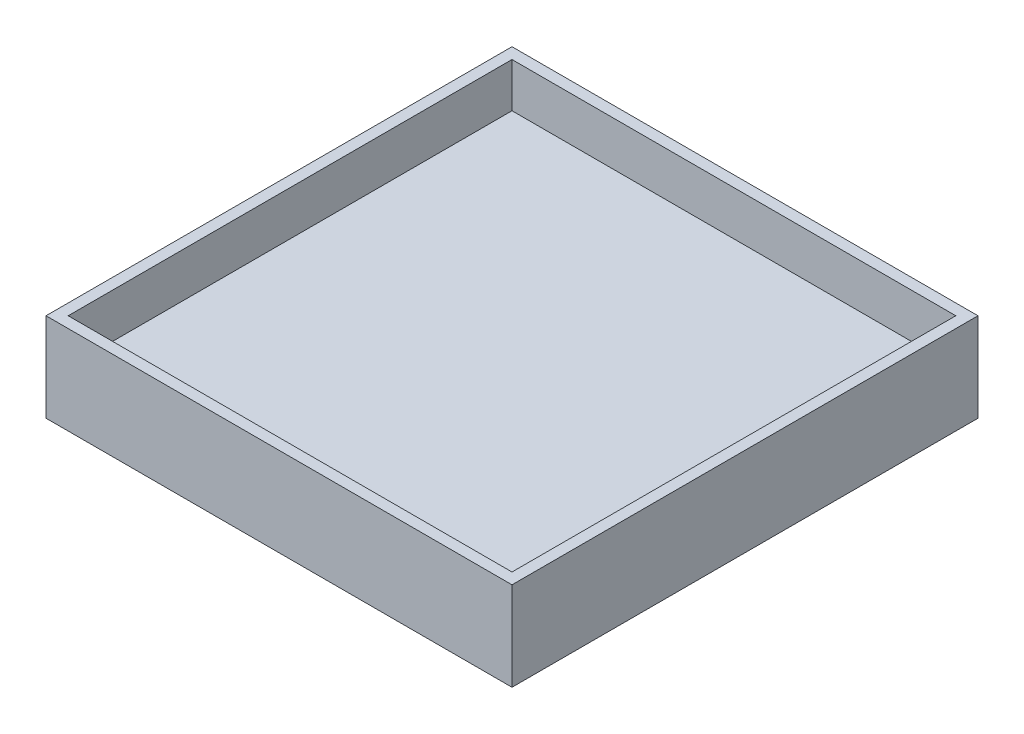
ISO-10303-21;
HEADER;
FILE_DESCRIPTION(('STEP AP214'),'2;1');
FILE_NAME('part.step','',(''),(''),'','','');
FILE_SCHEMA(('AUTOMOTIVE_DESIGN { 1 0 10303 214 1 1 1 1 }'));
ENDSEC;
DATA;
#1=APPLICATION_CONTEXT('core data for automotive mechanical design processes');
#2=APPLICATION_PROTOCOL_DEFINITION('international standard','automotive_design',2000,#1);
#3=PRODUCT_CONTEXT('',#1,'mechanical');
#4=PRODUCT('Part','Part','',(#3));
#5=PRODUCT_RELATED_PRODUCT_CATEGORY('part','',(#4));
#6=PRODUCT_DEFINITION_FORMATION('','',#4);
#7=PRODUCT_DEFINITION_CONTEXT('part definition',#1,'design');
#8=PRODUCT_DEFINITION('design','',#6,#7);
#9=PRODUCT_DEFINITION_SHAPE('','',#8);
#10=(LENGTH_UNIT() NAMED_UNIT(*) SI_UNIT(.MILLI.,.METRE.));
#11=(NAMED_UNIT(*) PLANE_ANGLE_UNIT() SI_UNIT($,.RADIAN.));
#12=(NAMED_UNIT(*) SI_UNIT($,.STERADIAN.) SOLID_ANGLE_UNIT());
#13=UNCERTAINTY_MEASURE_WITH_UNIT(LENGTH_MEASURE(1.E-05),#10,'distance_accuracy_value','');
#14=(GEOMETRIC_REPRESENTATION_CONTEXT(3) GLOBAL_UNCERTAINTY_ASSIGNED_CONTEXT((#13)) GLOBAL_UNIT_ASSIGNED_CONTEXT((#10,
#11,#12)) REPRESENTATION_CONTEXT('',''));
#15=CARTESIAN_POINT('',(0.,0.,0.));
#16=DIRECTION('',(0.,0.,1.));
#17=DIRECTION('',(1.,0.,0.));
#18=AXIS2_PLACEMENT_3D('',#15,#16,#17);
#19=CARTESIAN_POINT('',(0.,0.,0.));
#20=DIRECTION('',(0.,-1.,0.));
#21=DIRECTION('',(0.,0.,-1.));
#22=AXIS2_PLACEMENT_3D('',#19,#20,#21);
#23=PLANE('',#22);
#24=DIRECTION('',(0.,0.,1.));
#25=VECTOR('',#24,1.);
#26=CARTESIAN_POINT('',(15.,0.,0.));
#27=LINE('',#26,#25);
#28=CARTESIAN_POINT('',(15.,0.,17.5));
#29=VERTEX_POINT('',#28);
#30=CARTESIAN_POINT('',(15.,0.,-17.5));
#31=VERTEX_POINT('',#30);
#32=EDGE_CURVE('E256',#29,#31,#27,.F.);
#33=ORIENTED_EDGE('',*,*,#32,.T.);
#34=DIRECTION('',(1.,0.,0.));
#35=VECTOR('',#34,1.);
#36=CARTESIAN_POINT('',(0.,0.,-17.5));
#37=LINE('',#36,#35);
#38=CARTESIAN_POINT('',(-15.,0.,-17.5));
#39=VERTEX_POINT('',#38);
#40=EDGE_CURVE('E258',#31,#39,#37,.F.);
#41=ORIENTED_EDGE('',*,*,#40,.T.);
#42=DIRECTION('',(0.,0.,-1.));
#43=VECTOR('',#42,1.);
#44=CARTESIAN_POINT('',(-15.,0.,0.));
#45=LINE('',#44,#43);
#46=CARTESIAN_POINT('',(-15.,0.,17.5));
#47=VERTEX_POINT('',#46);
#48=EDGE_CURVE('E252',#39,#47,#45,.F.);
#49=ORIENTED_EDGE('',*,*,#48,.T.);
#50=DIRECTION('',(-1.,0.,0.));
#51=VECTOR('',#50,1.);
#52=CARTESIAN_POINT('',(0.,0.,17.5));
#53=LINE('',#52,#51);
#54=EDGE_CURVE('E254',#47,#29,#53,.F.);
#55=ORIENTED_EDGE('',*,*,#54,.T.);
#56=EDGE_LOOP('',(#33,#41,#49,#55));
#57=FACE_BOUND('',#56,.T.);
#58=DIRECTION('',(0.,0.,-1.));
#59=VECTOR('',#58,1.);
#60=CARTESIAN_POINT('',(-525.,0.,525.));
#61=LINE('',#60,#59);
#62=CARTESIAN_POINT('',(-525.,0.,525.));
#63=VERTEX_POINT('',#62);
#64=CARTESIAN_POINT('',(-525.,0.,-525.));
#65=VERTEX_POINT('',#64);
#66=EDGE_CURVE('E206',#63,#65,#61,.T.);
#67=ORIENTED_EDGE('',*,*,#66,.T.);
#68=DIRECTION('',(1.,0.,0.));
#69=VECTOR('',#68,1.);
#70=CARTESIAN_POINT('',(-525.,0.,-525.));
#71=LINE('',#70,#69);
#72=CARTESIAN_POINT('',(525.,0.,-525.));
#73=VERTEX_POINT('',#72);
#74=EDGE_CURVE('E225',#65,#73,#71,.T.);
#75=ORIENTED_EDGE('',*,*,#74,.T.);
#76=DIRECTION('',(0.,0.,-1.));
#77=VECTOR('',#76,1.);
#78=CARTESIAN_POINT('',(525.,0.,525.));
#79=LINE('',#78,#77);
#80=CARTESIAN_POINT('',(525.,0.,525.));
#81=VERTEX_POINT('',#80);
#82=EDGE_CURVE('E228',#81,#73,#79,.T.);
#83=ORIENTED_EDGE('',*,*,#82,.F.);
#84=DIRECTION('',(1.,0.,0.));
#85=VECTOR('',#84,1.);
#86=CARTESIAN_POINT('',(-525.,0.,525.));
#87=LINE('',#86,#85);
#88=EDGE_CURVE('E215',#63,#81,#87,.T.);
#89=ORIENTED_EDGE('',*,*,#88,.F.);
#90=EDGE_LOOP('',(#67,#75,#83,#89));
#91=FACE_BOUND('',#90,.T.);
#92=ADVANCED_FACE('F57',(#57,#91),#23,.T.);
#93=CARTESIAN_POINT('',(0.,100.,0.));
#94=DIRECTION('',(0.,-1.,0.));
#95=DIRECTION('',(0.,0.,-1.));
#96=AXIS2_PLACEMENT_3D('',#93,#94,#95);
#97=PLANE('',#96);
#98=DIRECTION('',(0.,0.,-1.));
#99=VECTOR('',#98,1.);
#100=CARTESIAN_POINT('',(500.,100.,500.));
#101=LINE('',#100,#99);
#102=CARTESIAN_POINT('',(500.,100.,500.));
#103=VERTEX_POINT('',#102);
#104=CARTESIAN_POINT('',(500.,100.,-500.));
#105=VERTEX_POINT('',#104);
#106=EDGE_CURVE('E234',#103,#105,#101,.T.);
#107=ORIENTED_EDGE('',*,*,#106,.T.);
#108=DIRECTION('',(-1.,0.,0.));
#109=VECTOR('',#108,1.);
#110=CARTESIAN_POINT('',(-500.,100.,-500.));
#111=LINE('',#110,#109);
#112=CARTESIAN_POINT('',(-500.,100.,-500.));
#113=VERTEX_POINT('',#112);
#114=EDGE_CURVE('E243',#105,#113,#111,.T.);
#115=ORIENTED_EDGE('',*,*,#114,.T.);
#116=DIRECTION('',(0.,0.,1.));
#117=VECTOR('',#116,1.);
#118=CARTESIAN_POINT('',(-500.,100.,500.));
#119=LINE('',#118,#117);
#120=CARTESIAN_POINT('',(-500.,100.,500.));
#121=VERTEX_POINT('',#120);
#122=EDGE_CURVE('E179',#113,#121,#119,.T.);
#123=ORIENTED_EDGE('',*,*,#122,.T.);
#124=DIRECTION('',(1.,0.,0.));
#125=VECTOR('',#124,1.);
#126=CARTESIAN_POINT('',(-500.,100.,500.));
#127=LINE('',#126,#125);
#128=EDGE_CURVE('E246',#121,#103,#127,.T.);
#129=ORIENTED_EDGE('',*,*,#128,.T.);
#130=EDGE_LOOP('',(#107,#115,#123,#129));
#131=FACE_BOUND('',#130,.T.);
#132=ADVANCED_FACE('F371',(#131),#97,.F.);
#133=CARTESIAN_POINT('',(-500.,200.,500.));
#134=DIRECTION('',(-1.,0.,0.));
#135=DIRECTION('',(0.,0.,1.));
#136=AXIS2_PLACEMENT_3D('',#133,#134,#135);
#137=PLANE('',#136);
#138=DIRECTION('',(0.,-1.,0.));
#139=VECTOR('',#138,1.);
#140=CARTESIAN_POINT('',(-500.,200.,500.));
#141=LINE('',#140,#139);
#142=CARTESIAN_POINT('',(-500.,200.,500.));
#143=VERTEX_POINT('',#142);
#144=EDGE_CURVE('E204',#143,#121,#141,.T.);
#145=ORIENTED_EDGE('',*,*,#144,.T.);
#146=ORIENTED_EDGE('',*,*,#122,.F.);
#147=DIRECTION('',(0.,-1.,0.));
#148=VECTOR('',#147,1.);
#149=CARTESIAN_POINT('',(-500.,200.,-500.));
#150=LINE('',#149,#148);
#151=CARTESIAN_POINT('',(-500.,200.,-500.));
#152=VERTEX_POINT('',#151);
#153=EDGE_CURVE('E171',#152,#113,#150,.T.);
#154=ORIENTED_EDGE('',*,*,#153,.F.);
#155=DIRECTION('',(0.,0.,-1.));
#156=VECTOR('',#155,1.);
#157=CARTESIAN_POINT('',(-500.,200.,500.));
#158=LINE('',#157,#156);
#159=EDGE_CURVE('E176',#143,#152,#158,.T.);
#160=ORIENTED_EDGE('',*,*,#159,.F.);
#161=EDGE_LOOP('',(#145,#146,#154,#160));
#162=FACE_BOUND('',#161,.T.);
#163=ADVANCED_FACE('F174',(#162),#137,.F.);
#164=CARTESIAN_POINT('',(-500.,200.,500.));
#165=DIRECTION('',(0.,0.,-1.));
#166=DIRECTION('',(-1.,0.,0.));
#167=AXIS2_PLACEMENT_3D('',#164,#165,#166);
#168=PLANE('',#167);
#169=ORIENTED_EDGE('',*,*,#128,.F.);
#170=ORIENTED_EDGE('',*,*,#144,.F.);
#171=DIRECTION('',(1.,0.,0.));
#172=VECTOR('',#171,1.);
#173=CARTESIAN_POINT('',(-500.,200.,500.));
#174=LINE('',#173,#172);
#175=CARTESIAN_POINT('',(500.,200.,500.));
#176=VERTEX_POINT('',#175);
#177=EDGE_CURVE('E183',#143,#176,#174,.T.);
#178=ORIENTED_EDGE('',*,*,#177,.T.);
#179=DIRECTION('',(0.,-1.,0.));
#180=VECTOR('',#179,1.);
#181=CARTESIAN_POINT('',(500.,200.,500.));
#182=LINE('',#181,#180);
#183=EDGE_CURVE('E207',#176,#103,#182,.T.);
#184=ORIENTED_EDGE('',*,*,#183,.T.);
#185=EDGE_LOOP('',(#169,#170,#178,#184));
#186=FACE_BOUND('',#185,.T.);
#187=ADVANCED_FACE('F544',(#186),#168,.T.);
#188=CARTESIAN_POINT('',(500.,200.,500.));
#189=DIRECTION('',(-1.,0.,0.));
#190=DIRECTION('',(0.,0.,1.));
#191=AXIS2_PLACEMENT_3D('',#188,#189,#190);
#192=PLANE('',#191);
#193=ORIENTED_EDGE('',*,*,#106,.F.);
#194=ORIENTED_EDGE('',*,*,#183,.F.);
#195=DIRECTION('',(0.,0.,-1.));
#196=VECTOR('',#195,1.);
#197=CARTESIAN_POINT('',(500.,200.,500.));
#198=LINE('',#197,#196);
#199=CARTESIAN_POINT('',(500.,200.,-500.));
#200=VERTEX_POINT('',#199);
#201=EDGE_CURVE('E192',#176,#200,#198,.T.);
#202=ORIENTED_EDGE('',*,*,#201,.T.);
#203=DIRECTION('',(0.,-1.,0.));
#204=VECTOR('',#203,1.);
#205=CARTESIAN_POINT('',(500.,200.,-500.));
#206=LINE('',#205,#204);
#207=EDGE_CURVE('E182',#200,#105,#206,.T.);
#208=ORIENTED_EDGE('',*,*,#207,.T.);
#209=EDGE_LOOP('',(#193,#194,#202,#208));
#210=FACE_BOUND('',#209,.T.);
#211=ADVANCED_FACE('F537',(#210),#192,.T.);
#212=CARTESIAN_POINT('',(-500.,200.,-500.));
#213=DIRECTION('',(0.,0.,-1.));
#214=DIRECTION('',(-1.,0.,0.));
#215=AXIS2_PLACEMENT_3D('',#212,#213,#214);
#216=PLANE('',#215);
#217=ORIENTED_EDGE('',*,*,#153,.T.);
#218=ORIENTED_EDGE('',*,*,#114,.F.);
#219=ORIENTED_EDGE('',*,*,#207,.F.);
#220=DIRECTION('',(1.,0.,0.));
#221=VECTOR('',#220,1.);
#222=CARTESIAN_POINT('',(-500.,200.,-500.));
#223=LINE('',#222,#221);
#224=EDGE_CURVE('E186',#152,#200,#223,.T.);
#225=ORIENTED_EDGE('',*,*,#224,.F.);
#226=EDGE_LOOP('',(#217,#218,#219,#225));
#227=FACE_BOUND('',#226,.T.);
#228=ADVANCED_FACE('F187',(#227),#216,.F.);
#229=CARTESIAN_POINT('',(-525.,200.,525.));
#230=DIRECTION('',(-1.,0.,0.));
#231=DIRECTION('',(0.,0.,1.));
#232=AXIS2_PLACEMENT_3D('',#229,#230,#231);
#233=PLANE('',#232);
#234=ORIENTED_EDGE('',*,*,#66,.F.);
#235=DIRECTION('',(0.,-1.,0.));
#236=VECTOR('',#235,1.);
#237=CARTESIAN_POINT('',(-525.,200.,525.));
#238=LINE('',#237,#236);
#239=CARTESIAN_POINT('',(-525.,200.,525.));
#240=VERTEX_POINT('',#239);
#241=EDGE_CURVE('E232',#240,#63,#238,.T.);
#242=ORIENTED_EDGE('',*,*,#241,.F.);
#243=DIRECTION('',(0.,0.,-1.));
#244=VECTOR('',#243,1.);
#245=CARTESIAN_POINT('',(-525.,200.,525.));
#246=LINE('',#245,#244);
#247=CARTESIAN_POINT('',(-525.,200.,-525.));
#248=VERTEX_POINT('',#247);
#249=EDGE_CURVE('E211',#240,#248,#246,.T.);
#250=ORIENTED_EDGE('',*,*,#249,.T.);
#251=DIRECTION('',(0.,-1.,0.));
#252=VECTOR('',#251,1.);
#253=CARTESIAN_POINT('',(-525.,200.,-525.));
#254=LINE('',#253,#252);
#255=EDGE_CURVE('E222',#248,#65,#254,.T.);
#256=ORIENTED_EDGE('',*,*,#255,.T.);
#257=EDGE_LOOP('',(#234,#242,#250,#256));
#258=FACE_BOUND('',#257,.T.);
#259=ADVANCED_FACE('F523',(#258),#233,.T.);
#260=CARTESIAN_POINT('',(-525.,200.,525.));
#261=DIRECTION('',(0.,0.,-1.));
#262=DIRECTION('',(-1.,0.,0.));
#263=AXIS2_PLACEMENT_3D('',#260,#261,#262);
#264=PLANE('',#263);
#265=ORIENTED_EDGE('',*,*,#88,.T.);
#266=DIRECTION('',(0.,-1.,0.));
#267=VECTOR('',#266,1.);
#268=CARTESIAN_POINT('',(525.,200.,525.));
#269=LINE('',#268,#267);
#270=CARTESIAN_POINT('',(525.,200.,525.));
#271=VERTEX_POINT('',#270);
#272=EDGE_CURVE('E235',#271,#81,#269,.T.);
#273=ORIENTED_EDGE('',*,*,#272,.F.);
#274=DIRECTION('',(1.,0.,0.));
#275=VECTOR('',#274,1.);
#276=CARTESIAN_POINT('',(-525.,200.,525.));
#277=LINE('',#276,#275);
#278=EDGE_CURVE('E220',#240,#271,#277,.T.);
#279=ORIENTED_EDGE('',*,*,#278,.F.);
#280=ORIENTED_EDGE('',*,*,#241,.T.);
#281=EDGE_LOOP('',(#265,#273,#279,#280));
#282=FACE_BOUND('',#281,.T.);
#283=ADVANCED_FACE('F515',(#282),#264,.F.);
#284=CARTESIAN_POINT('',(525.,200.,525.));
#285=DIRECTION('',(-1.,0.,0.));
#286=DIRECTION('',(0.,0.,1.));
#287=AXIS2_PLACEMENT_3D('',#284,#285,#286);
#288=PLANE('',#287);
#289=ORIENTED_EDGE('',*,*,#82,.T.);
#290=DIRECTION('',(0.,-1.,0.));
#291=VECTOR('',#290,1.);
#292=CARTESIAN_POINT('',(525.,200.,-525.));
#293=LINE('',#292,#291);
#294=CARTESIAN_POINT('',(525.,200.,-525.));
#295=VERTEX_POINT('',#294);
#296=EDGE_CURVE('E238',#295,#73,#293,.T.);
#297=ORIENTED_EDGE('',*,*,#296,.F.);
#298=DIRECTION('',(0.,0.,-1.));
#299=VECTOR('',#298,1.);
#300=CARTESIAN_POINT('',(525.,200.,525.));
#301=LINE('',#300,#299);
#302=EDGE_CURVE('E218',#271,#295,#301,.T.);
#303=ORIENTED_EDGE('',*,*,#302,.F.);
#304=ORIENTED_EDGE('',*,*,#272,.T.);
#305=EDGE_LOOP('',(#289,#297,#303,#304));
#306=FACE_BOUND('',#305,.T.);
#307=ADVANCED_FACE('F507',(#306),#288,.F.);
#308=CARTESIAN_POINT('',(-525.,200.,-525.));
#309=DIRECTION('',(0.,0.,-1.));
#310=DIRECTION('',(-1.,0.,0.));
#311=AXIS2_PLACEMENT_3D('',#308,#309,#310);
#312=PLANE('',#311);
#313=ORIENTED_EDGE('',*,*,#74,.F.);
#314=ORIENTED_EDGE('',*,*,#255,.F.);
#315=DIRECTION('',(1.,0.,0.));
#316=VECTOR('',#315,1.);
#317=CARTESIAN_POINT('',(-525.,200.,-525.));
#318=LINE('',#317,#316);
#319=EDGE_CURVE('E214',#248,#295,#318,.T.);
#320=ORIENTED_EDGE('',*,*,#319,.T.);
#321=ORIENTED_EDGE('',*,*,#296,.T.);
#322=EDGE_LOOP('',(#313,#314,#320,#321));
#323=FACE_BOUND('',#322,.T.);
#324=ADVANCED_FACE('F500',(#323),#312,.T.);
#325=CARTESIAN_POINT('',(0.,200.,0.));
#326=DIRECTION('',(0.,-1.,0.));
#327=DIRECTION('',(0.,0.,-1.));
#328=AXIS2_PLACEMENT_3D('',#325,#326,#327);
#329=PLANE('',#328);
#330=ORIENTED_EDGE('',*,*,#177,.F.);
#331=ORIENTED_EDGE('',*,*,#159,.T.);
#332=ORIENTED_EDGE('',*,*,#224,.T.);
#333=ORIENTED_EDGE('',*,*,#201,.F.);
#334=EDGE_LOOP('',(#330,#331,#332,#333));
#335=FACE_BOUND('',#334,.T.);
#336=ORIENTED_EDGE('',*,*,#249,.F.);
#337=ORIENTED_EDGE('',*,*,#278,.T.);
#338=ORIENTED_EDGE('',*,*,#302,.T.);
#339=ORIENTED_EDGE('',*,*,#319,.F.);
#340=EDGE_LOOP('',(#336,#337,#338,#339));
#341=FACE_BOUND('',#340,.T.);
#342=ADVANCED_FACE('F194',(#335,#341),#329,.F.);
#343=CARTESIAN_POINT('',(12.5,-25.,15.));
#344=DIRECTION('',(-1.,0.,0.));
#345=DIRECTION('',(0.,0.,1.));
#346=AXIS2_PLACEMENT_3D('',#343,#344,#345);
#347=PLANE('',#346);
#348=DIRECTION('',(0.,1.,0.));
#349=VECTOR('',#348,1.);
#350=CARTESIAN_POINT('',(12.5,-25.,15.));
#351=LINE('',#350,#349);
#352=CARTESIAN_POINT('',(12.5,-15.,15.));
#353=VERTEX_POINT('',#352);
#354=CARTESIAN_POINT('',(12.5,-2.5,15.));
#355=VERTEX_POINT('',#354);
#356=EDGE_CURVE('E196',#353,#355,#351,.T.);
#357=ORIENTED_EDGE('',*,*,#356,.F.);
#358=DIRECTION('',(0.,0.,1.));
#359=VECTOR('',#358,1.);
#360=CARTESIAN_POINT('',(12.5,-15.,-15.));
#361=LINE('',#360,#359);
#362=CARTESIAN_POINT('',(12.5,-15.,-15.));
#363=VERTEX_POINT('',#362);
#364=EDGE_CURVE('E81',#353,#363,#361,.F.);
#365=ORIENTED_EDGE('',*,*,#364,.T.);
#366=DIRECTION('',(0.,1.,0.));
#367=VECTOR('',#366,1.);
#368=CARTESIAN_POINT('',(12.5,-25.,-15.));
#369=LINE('',#368,#367);
#370=CARTESIAN_POINT('',(12.5,-2.5,-15.));
#371=VERTEX_POINT('',#370);
#372=EDGE_CURVE('E299',#363,#371,#369,.T.);
#373=ORIENTED_EDGE('',*,*,#372,.T.);
#374=DIRECTION('',(0.,0.,1.));
#375=VECTOR('',#374,1.);
#376=CARTESIAN_POINT('',(12.5,-2.5,15.));
#377=LINE('',#376,#375);
#378=EDGE_CURVE('E261',#371,#355,#377,.T.);
#379=ORIENTED_EDGE('',*,*,#378,.T.);
#380=EDGE_LOOP('',(#357,#365,#373,#379));
#381=FACE_BOUND('',#380,.T.);
#382=ADVANCED_FACE('F311',(#381),#347,.F.);
#383=CARTESIAN_POINT('',(-12.5,-25.,15.));
#384=DIRECTION('',(0.,0.,-1.));
#385=DIRECTION('',(-1.,0.,0.));
#386=AXIS2_PLACEMENT_3D('',#383,#384,#385);
#387=PLANE('',#386);
#388=CARTESIAN_POINT('',(0.,-17.5,15.));
#389=DIRECTION('',(0.,0.,-1.));
#390=DIRECTION('',(-1.,0.,0.));
#391=AXIS2_PLACEMENT_3D('',#388,#389,#390);
#392=CIRCLE('',#391,5.);
#393=CARTESIAN_POINT('',(-5.00000000000001,-17.5,15.));
#394=VERTEX_POINT('',#393);
#395=EDGE_CURVE('E275',#394,#394,#392,.T.);
#396=ORIENTED_EDGE('',*,*,#395,.T.);
#397=EDGE_LOOP('',(#396));
#398=FACE_BOUND('',#397,.T.);
#399=DIRECTION('',(-1.,0.,0.));
#400=VECTOR('',#399,1.);
#401=CARTESIAN_POINT('',(-12.5,-25.,15.));
#402=LINE('',#401,#400);
#403=CARTESIAN_POINT('',(2.5,-25.,15.));
#404=VERTEX_POINT('',#403);
#405=CARTESIAN_POINT('',(-2.50000000000001,-25.,15.));
#406=VERTEX_POINT('',#405);
#407=EDGE_CURVE('E283',#404,#406,#402,.T.);
#408=ORIENTED_EDGE('',*,*,#407,.F.);
#409=CARTESIAN_POINT('',(2.5,-15.,15.));
#410=DIRECTION('',(0.,0.,-1.));
#411=DIRECTION('',(-1.,0.,0.));
#412=AXIS2_PLACEMENT_3D('',#409,#410,#411);
#413=CIRCLE('',#412,10.);
#414=EDGE_CURVE('E291',#404,#353,#413,.F.);
#415=ORIENTED_EDGE('',*,*,#414,.T.);
#416=ORIENTED_EDGE('',*,*,#356,.T.);
#417=DIRECTION('',(-1.,0.,0.));
#418=VECTOR('',#417,1.);
#419=CARTESIAN_POINT('',(-12.5,-2.5,15.));
#420=LINE('',#419,#418);
#421=CARTESIAN_POINT('',(-12.5,-2.5,15.));
#422=VERTEX_POINT('',#421);
#423=EDGE_CURVE('E264',#355,#422,#420,.T.);
#424=ORIENTED_EDGE('',*,*,#423,.T.);
#425=DIRECTION('',(0.,1.,0.));
#426=VECTOR('',#425,1.);
#427=CARTESIAN_POINT('',(-12.5,-25.,15.));
#428=LINE('',#427,#426);
#429=CARTESIAN_POINT('',(-12.5,-15.,15.));
#430=VERTEX_POINT('',#429);
#431=EDGE_CURVE('E198',#430,#422,#428,.T.);
#432=ORIENTED_EDGE('',*,*,#431,.F.);
#433=CARTESIAN_POINT('',(-2.50000000000001,-15.,15.));
#434=DIRECTION('',(0.,0.,-1.));
#435=DIRECTION('',(-1.,0.,0.));
#436=AXIS2_PLACEMENT_3D('',#433,#434,#435);
#437=CIRCLE('',#436,10.);
#438=EDGE_CURVE('E289',#430,#406,#437,.F.);
#439=ORIENTED_EDGE('',*,*,#438,.T.);
#440=EDGE_LOOP('',(#408,#415,#416,#424,#432,#439));
#441=FACE_BOUND('',#440,.T.);
#442=ADVANCED_FACE('F310',(#398,#441),#387,.F.);
#443=CARTESIAN_POINT('',(-12.5,-25.,15.));
#444=DIRECTION('',(1.,0.,0.));
#445=DIRECTION('',(0.,0.,-1.));
#446=AXIS2_PLACEMENT_3D('',#443,#444,#445);
#447=PLANE('',#446);
#448=DIRECTION('',(0.,1.,0.));
#449=VECTOR('',#448,1.);
#450=CARTESIAN_POINT('',(-12.5,-25.,-15.));
#451=LINE('',#450,#449);
#452=CARTESIAN_POINT('',(-12.5,-15.,-15.));
#453=VERTEX_POINT('',#452);
#454=CARTESIAN_POINT('',(-12.5,-2.5,-15.));
#455=VERTEX_POINT('',#454);
#456=EDGE_CURVE('E337',#453,#455,#451,.T.);
#457=ORIENTED_EDGE('',*,*,#456,.F.);
#458=DIRECTION('',(0.,0.,-1.));
#459=VECTOR('',#458,1.);
#460=CARTESIAN_POINT('',(-12.5,-15.,15.));
#461=LINE('',#460,#459);
#462=EDGE_CURVE('E12',#453,#430,#461,.F.);
#463=ORIENTED_EDGE('',*,*,#462,.T.);
#464=ORIENTED_EDGE('',*,*,#431,.T.);
#465=DIRECTION('',(0.,0.,-1.));
#466=VECTOR('',#465,1.);
#467=CARTESIAN_POINT('',(-12.5,-2.5,15.));
#468=LINE('',#467,#466);
#469=EDGE_CURVE('E267',#422,#455,#468,.T.);
#470=ORIENTED_EDGE('',*,*,#469,.T.);
#471=EDGE_LOOP('',(#457,#463,#464,#470));
#472=FACE_BOUND('',#471,.T.);
#473=ADVANCED_FACE('F336',(#472),#447,.F.);
#474=CARTESIAN_POINT('',(-12.5,-25.,-15.));
#475=DIRECTION('',(0.,0.,1.));
#476=DIRECTION('',(1.,0.,0.));
#477=AXIS2_PLACEMENT_3D('',#474,#475,#476);
#478=PLANE('',#477);
#479=CARTESIAN_POINT('',(0.,-17.5,-15.));
#480=DIRECTION('',(0.,0.,1.));
#481=DIRECTION('',(1.,0.,0.));
#482=AXIS2_PLACEMENT_3D('',#479,#480,#481);
#483=CIRCLE('',#482,5.);
#484=CARTESIAN_POINT('',(5.,-17.5,-15.));
#485=VERTEX_POINT('',#484);
#486=EDGE_CURVE('E61',#485,#485,#483,.T.);
#487=ORIENTED_EDGE('',*,*,#486,.T.);
#488=EDGE_LOOP('',(#487));
#489=FACE_BOUND('',#488,.T.);
#490=ORIENTED_EDGE('',*,*,#372,.F.);
#491=CARTESIAN_POINT('',(2.5,-15.,-15.));
#492=DIRECTION('',(0.,0.,1.));
#493=DIRECTION('',(1.,0.,0.));
#494=AXIS2_PLACEMENT_3D('',#491,#492,#493);
#495=CIRCLE('',#494,10.);
#496=CARTESIAN_POINT('',(2.5,-25.,-15.));
#497=VERTEX_POINT('',#496);
#498=EDGE_CURVE('E66',#363,#497,#495,.F.);
#499=ORIENTED_EDGE('',*,*,#498,.T.);
#500=DIRECTION('',(1.,0.,0.));
#501=VECTOR('',#500,1.);
#502=CARTESIAN_POINT('',(-12.5,-25.,-15.));
#503=LINE('',#502,#501);
#504=CARTESIAN_POINT('',(-2.5,-25.,-15.));
#505=VERTEX_POINT('',#504);
#506=EDGE_CURVE('E298',#505,#497,#503,.T.);
#507=ORIENTED_EDGE('',*,*,#506,.F.);
#508=CARTESIAN_POINT('',(-2.5,-15.,-15.));
#509=DIRECTION('',(0.,0.,1.));
#510=DIRECTION('',(1.,0.,0.));
#511=AXIS2_PLACEMENT_3D('',#508,#509,#510);
#512=CIRCLE('',#511,10.);
#513=EDGE_CURVE('E73',#505,#453,#512,.F.);
#514=ORIENTED_EDGE('',*,*,#513,.T.);
#515=ORIENTED_EDGE('',*,*,#456,.T.);
#516=DIRECTION('',(1.,0.,0.));
#517=VECTOR('',#516,1.);
#518=CARTESIAN_POINT('',(-12.5,-2.5,-15.));
#519=LINE('',#518,#517);
#520=EDGE_CURVE('E249',#455,#371,#519,.T.);
#521=ORIENTED_EDGE('',*,*,#520,.T.);
#522=EDGE_LOOP('',(#490,#499,#507,#514,#515,#521));
#523=FACE_BOUND('',#522,.T.);
#524=ADVANCED_FACE('F297',(#489,#523),#478,.F.);
#525=CARTESIAN_POINT('',(0.,-25.,0.));
#526=DIRECTION('',(0.,-1.,0.));
#527=DIRECTION('',(0.,0.,-1.));
#528=AXIS2_PLACEMENT_3D('',#525,#526,#527);
#529=PLANE('',#528);
#530=ORIENTED_EDGE('',*,*,#506,.T.);
#531=DIRECTION('',(0.,0.,1.));
#532=VECTOR('',#531,1.);
#533=CARTESIAN_POINT('',(2.5,-25.,15.));
#534=LINE('',#533,#532);
#535=EDGE_CURVE('E286',#497,#404,#534,.T.);
#536=ORIENTED_EDGE('',*,*,#535,.T.);
#537=ORIENTED_EDGE('',*,*,#407,.T.);
#538=DIRECTION('',(0.,0.,-1.));
#539=VECTOR('',#538,1.);
#540=CARTESIAN_POINT('',(-2.5,-25.,-15.));
#541=LINE('',#540,#539);
#542=EDGE_CURVE('E270',#406,#505,#541,.T.);
#543=ORIENTED_EDGE('',*,*,#542,.T.);
#544=EDGE_LOOP('',(#530,#536,#537,#543));
#545=FACE_BOUND('',#544,.T.);
#546=ADVANCED_FACE('F303',(#545),#529,.T.);
#547=CARTESIAN_POINT('',(-12.5,-2.5,17.5));
#548=DIRECTION('',(-1.,0.,0.));
#549=DIRECTION('',(0.,0.,1.));
#550=AXIS2_PLACEMENT_3D('',#547,#548,#549);
#551=CYLINDRICAL_SURFACE('',#550,2.5);
#552=CARTESIAN_POINT('',(15.,-2.5,17.5));
#553=DIRECTION('',(-0.707106781186548,0.,0.707106781186547));
#554=DIRECTION('',(-0.707106781186547,0.,-0.707106781186548));
#555=AXIS2_PLACEMENT_3D('',#552,#553,#554);
#556=ELLIPSE('',#555,3.53553390593274,2.5);
#557=EDGE_CURVE('E277',#29,#355,#556,.T.);
#558=ORIENTED_EDGE('',*,*,#557,.F.);
#559=ORIENTED_EDGE('',*,*,#54,.F.);
#560=CARTESIAN_POINT('',(-15.,-2.5,17.5));
#561=DIRECTION('',(-0.707106781186547,0.,-0.707106781186548));
#562=DIRECTION('',(0.707106781186548,0.,-0.707106781186547));
#563=AXIS2_PLACEMENT_3D('',#560,#561,#562);
#564=ELLIPSE('',#563,3.53553390593274,2.5);
#565=EDGE_CURVE('E280',#422,#47,#564,.F.);
#566=ORIENTED_EDGE('',*,*,#565,.F.);
#567=ORIENTED_EDGE('',*,*,#423,.F.);
#568=EDGE_LOOP('',(#558,#559,#566,#567));
#569=FACE_BOUND('',#568,.T.);
#570=ADVANCED_FACE('F319',(#569),#551,.F.);
#571=CARTESIAN_POINT('',(-15.,-2.5,15.));
#572=DIRECTION('',(0.,0.,-1.));
#573=DIRECTION('',(-1.,0.,0.));
#574=AXIS2_PLACEMENT_3D('',#571,#572,#573);
#575=CYLINDRICAL_SURFACE('',#574,2.5);
#576=ORIENTED_EDGE('',*,*,#565,.T.);
#577=ORIENTED_EDGE('',*,*,#48,.F.);
#578=CARTESIAN_POINT('',(-15.,-2.5,-17.5));
#579=DIRECTION('',(0.707106781186548,0.,-0.707106781186547));
#580=DIRECTION('',(-0.707106781186547,0.,-0.707106781186548));
#581=AXIS2_PLACEMENT_3D('',#578,#579,#580);
#582=ELLIPSE('',#581,3.53553390593274,2.5);
#583=EDGE_CURVE('E274',#455,#39,#582,.F.);
#584=ORIENTED_EDGE('',*,*,#583,.F.);
#585=ORIENTED_EDGE('',*,*,#469,.F.);
#586=EDGE_LOOP('',(#576,#577,#584,#585));
#587=FACE_BOUND('',#586,.T.);
#588=ADVANCED_FACE('F334',(#587),#575,.F.);
#589=CARTESIAN_POINT('',(15.,-2.5,15.));
#590=DIRECTION('',(0.,0.,1.));
#591=DIRECTION('',(1.,0.,0.));
#592=AXIS2_PLACEMENT_3D('',#589,#590,#591);
#593=CYLINDRICAL_SURFACE('',#592,2.5);
#594=ORIENTED_EDGE('',*,*,#557,.T.);
#595=ORIENTED_EDGE('',*,*,#378,.F.);
#596=CARTESIAN_POINT('',(15.,-2.5,-17.5));
#597=DIRECTION('',(0.707106781186547,0.,0.707106781186548));
#598=DIRECTION('',(-0.707106781186548,0.,0.707106781186547));
#599=AXIS2_PLACEMENT_3D('',#596,#597,#598);
#600=ELLIPSE('',#599,3.53553390593274,2.5);
#601=EDGE_CURVE('E271',#31,#371,#600,.T.);
#602=ORIENTED_EDGE('',*,*,#601,.F.);
#603=ORIENTED_EDGE('',*,*,#32,.F.);
#604=EDGE_LOOP('',(#594,#595,#602,#603));
#605=FACE_BOUND('',#604,.T.);
#606=ADVANCED_FACE('F324',(#605),#593,.F.);
#607=CARTESIAN_POINT('',(-12.5,-2.5,-17.5));
#608=DIRECTION('',(1.,0.,0.));
#609=DIRECTION('',(0.,0.,-1.));
#610=AXIS2_PLACEMENT_3D('',#607,#608,#609);
#611=CYLINDRICAL_SURFACE('',#610,2.5);
#612=ORIENTED_EDGE('',*,*,#583,.T.);
#613=ORIENTED_EDGE('',*,*,#40,.F.);
#614=ORIENTED_EDGE('',*,*,#601,.T.);
#615=ORIENTED_EDGE('',*,*,#520,.F.);
#616=EDGE_LOOP('',(#612,#613,#614,#615));
#617=FACE_BOUND('',#616,.T.);
#618=ADVANCED_FACE('F329',(#617),#611,.F.);
#619=CARTESIAN_POINT('',(2.5,-15.,0.));
#620=DIRECTION('',(0.,0.,-1.));
#621=DIRECTION('',(-1.,0.,0.));
#622=AXIS2_PLACEMENT_3D('',#619,#620,#621);
#623=CYLINDRICAL_SURFACE('',#622,10.);
#624=ORIENTED_EDGE('',*,*,#498,.F.);
#625=ORIENTED_EDGE('',*,*,#364,.F.);
#626=ORIENTED_EDGE('',*,*,#414,.F.);
#627=ORIENTED_EDGE('',*,*,#535,.F.);
#628=EDGE_LOOP('',(#624,#625,#626,#627));
#629=FACE_BOUND('',#628,.T.);
#630=ADVANCED_FACE('F308',(#629),#623,.T.);
#631=CARTESIAN_POINT('',(-2.5,-15.,0.));
#632=DIRECTION('',(0.,0.,1.));
#633=DIRECTION('',(1.,0.,0.));
#634=AXIS2_PLACEMENT_3D('',#631,#632,#633);
#635=CYLINDRICAL_SURFACE('',#634,10.);
#636=ORIENTED_EDGE('',*,*,#438,.F.);
#637=ORIENTED_EDGE('',*,*,#462,.F.);
#638=ORIENTED_EDGE('',*,*,#513,.F.);
#639=ORIENTED_EDGE('',*,*,#542,.F.);
#640=EDGE_LOOP('',(#636,#637,#638,#639));
#641=FACE_BOUND('',#640,.T.);
#642=ADVANCED_FACE('F59',(#641),#635,.T.);
#643=CARTESIAN_POINT('',(0.,-17.5,-32.5));
#644=DIRECTION('',(0.,0.,1.));
#645=DIRECTION('',(1.,0.,0.));
#646=AXIS2_PLACEMENT_3D('',#643,#644,#645);
#647=PLANE('',#646);
#648=CARTESIAN_POINT('',(0.,-17.5,-32.5));
#649=DIRECTION('',(0.,0.,1.));
#650=DIRECTION('',(1.,0.,0.));
#651=AXIS2_PLACEMENT_3D('',#648,#649,#650);
#652=CIRCLE('',#651,5.);
#653=CARTESIAN_POINT('',(5.,-17.5,-32.5));
#654=VERTEX_POINT('',#653);
#655=EDGE_CURVE('E346',#654,#654,#652,.T.);
#656=ORIENTED_EDGE('',*,*,#655,.F.);
#657=EDGE_LOOP('',(#656));
#658=FACE_BOUND('',#657,.T.);
#659=ADVANCED_FACE('F391',(#658),#647,.F.);
#660=CARTESIAN_POINT('',(0.,-17.5,-32.5));
#661=DIRECTION('',(0.,0.,1.));
#662=DIRECTION('',(1.,0.,0.));
#663=AXIS2_PLACEMENT_3D('',#660,#661,#662);
#664=CYLINDRICAL_SURFACE('',#663,5.);
#665=ORIENTED_EDGE('',*,*,#655,.T.);
#666=EDGE_LOOP('',(#665));
#667=FACE_BOUND('',#666,.T.);
#668=ORIENTED_EDGE('',*,*,#486,.F.);
#669=EDGE_LOOP('',(#668));
#670=FACE_BOUND('',#669,.T.);
#671=ADVANCED_FACE('F358',(#667,#670),#664,.T.);
#672=CARTESIAN_POINT('',(0.,-17.5,32.5));
#673=DIRECTION('',(0.,0.,1.));
#674=DIRECTION('',(1.,0.,0.));
#675=AXIS2_PLACEMENT_3D('',#672,#673,#674);
#676=CIRCLE('',#675,5.);
#677=CARTESIAN_POINT('',(5.,-17.5,32.5));
#678=VERTEX_POINT('',#677);
#679=EDGE_CURVE('E349',#678,#678,#676,.T.);
#680=ORIENTED_EDGE('',*,*,#679,.F.);
#681=EDGE_LOOP('',(#680));
#682=FACE_BOUND('',#681,.T.);
#683=ORIENTED_EDGE('',*,*,#395,.F.);
#684=EDGE_LOOP('',(#683));
#685=FACE_BOUND('',#684,.T.);
#686=ADVANCED_FACE('F355',(#682,#685),#664,.T.);
#687=CARTESIAN_POINT('',(0.,-17.5,32.5));
#688=DIRECTION('',(0.,0.,1.));
#689=DIRECTION('',(1.,0.,0.));
#690=AXIS2_PLACEMENT_3D('',#687,#688,#689);
#691=PLANE('',#690);
#692=ORIENTED_EDGE('',*,*,#679,.T.);
#693=EDGE_LOOP('',(#692));
#694=FACE_BOUND('',#693,.T.);
#695=ADVANCED_FACE('F353',(#694),#691,.T.);
#696=CLOSED_SHELL('',(#92,#132,#163,#187,#211,#228,#259,#283,#307,#324,#342,#382,#442,#473,#524,
#546,#570,#588,#606,#618,#630,#642,#659,#671,#686,#695));
#697=MANIFOLD_SOLID_BREP('B2',#696);
#698=ADVANCED_BREP_SHAPE_REPRESENTATION('',(#18,#697),#14);
#699=SHAPE_DEFINITION_REPRESENTATION(#9,#698);
ENDSEC;
END-ISO-10303-21;
